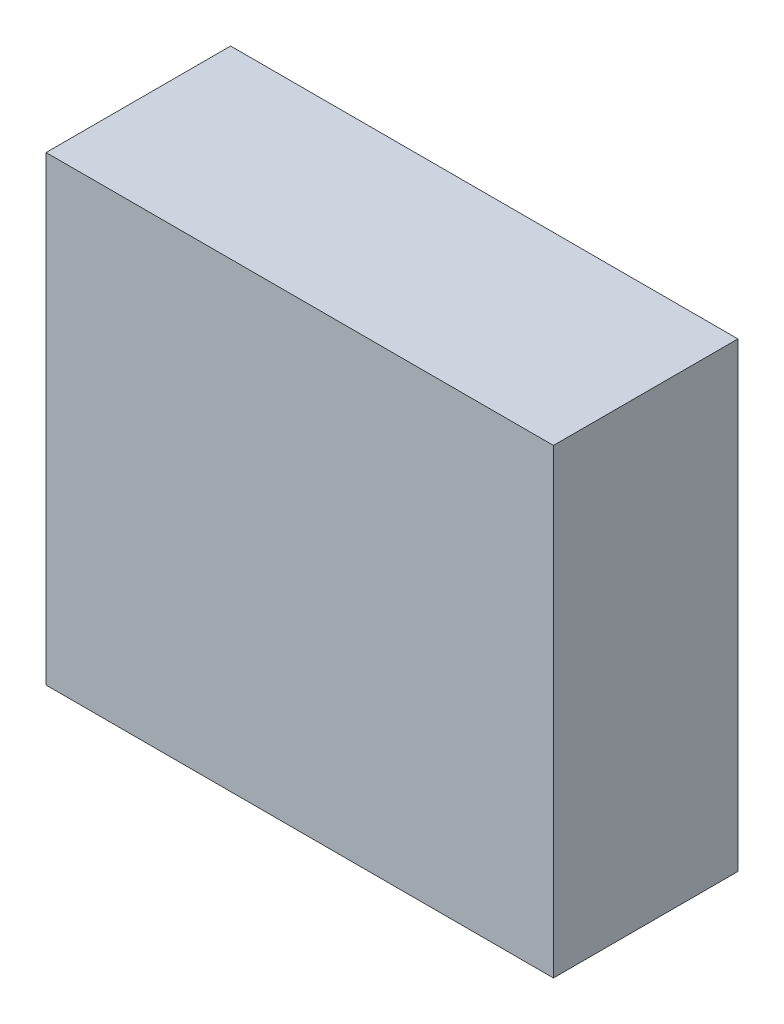
ISO-10303-21;
HEADER;
FILE_DESCRIPTION(('STEP AP214'),'2;1');
FILE_NAME('part.step','',(''),(''),'','','');
FILE_SCHEMA(('AUTOMOTIVE_DESIGN { 1 0 10303 214 1 1 1 1 }'));
ENDSEC;
DATA;
#1=APPLICATION_CONTEXT('core data for automotive mechanical design processes');
#2=APPLICATION_PROTOCOL_DEFINITION('international standard','automotive_design',2000,#1);
#3=PRODUCT_CONTEXT('',#1,'mechanical');
#4=PRODUCT('Part','Part','',(#3));
#5=PRODUCT_RELATED_PRODUCT_CATEGORY('part','',(#4));
#6=PRODUCT_DEFINITION_FORMATION('','',#4);
#7=PRODUCT_DEFINITION_CONTEXT('part definition',#1,'design');
#8=PRODUCT_DEFINITION('design','',#6,#7);
#9=PRODUCT_DEFINITION_SHAPE('','',#8);
#10=(LENGTH_UNIT() NAMED_UNIT(*) SI_UNIT(.MILLI.,.METRE.));
#11=(NAMED_UNIT(*) PLANE_ANGLE_UNIT() SI_UNIT($,.RADIAN.));
#12=(NAMED_UNIT(*) SI_UNIT($,.STERADIAN.) SOLID_ANGLE_UNIT());
#13=UNCERTAINTY_MEASURE_WITH_UNIT(LENGTH_MEASURE(1.E-05),#10,'distance_accuracy_value','');
#14=(GEOMETRIC_REPRESENTATION_CONTEXT(3) GLOBAL_UNCERTAINTY_ASSIGNED_CONTEXT((#13)) GLOBAL_UNIT_ASSIGNED_CONTEXT((#10,
#11,#12)) REPRESENTATION_CONTEXT('',''));
#15=CARTESIAN_POINT('',(0.,0.,0.));
#16=DIRECTION('',(0.,0.,1.));
#17=DIRECTION('',(1.,0.,0.));
#18=AXIS2_PLACEMENT_3D('',#15,#16,#17);
#19=CARTESIAN_POINT('',(44.015152,39.47668,1.13792));
#20=DIRECTION('',(0.,0.,1.));
#21=DIRECTION('',(0.,1.,0.));
#22=AXIS2_PLACEMENT_3D('',#19,#20,#21);
#23=PLANE('',#22);
#24=DIRECTION('',(0.,1.,0.));
#25=VECTOR('',#24,1.);
#26=CARTESIAN_POINT('',(42.8752,40.005,1.13792));
#27=LINE('',#26,#25);
#28=CARTESIAN_POINT('',(42.8752,40.513,1.13792));
#29=VERTEX_POINT('',#28);
#30=CARTESIAN_POINT('',(42.8752,39.497,1.13792));
#31=VERTEX_POINT('',#30);
#32=EDGE_CURVE('E76',#29,#31,#27,.F.);
#33=ORIENTED_EDGE('',*,*,#32,.T.);
#34=DIRECTION('',(-1.,0.,0.));
#35=VECTOR('',#34,1.);
#36=CARTESIAN_POINT('',(43.434,39.497,1.13792));
#37=LINE('',#36,#35);
#38=CARTESIAN_POINT('',(43.9928,39.497,1.13792));
#39=VERTEX_POINT('',#38);
#40=EDGE_CURVE('E58',#31,#39,#37,.F.);
#41=ORIENTED_EDGE('',*,*,#40,.T.);
#42=DIRECTION('',(0.,-1.,0.));
#43=VECTOR('',#42,1.);
#44=CARTESIAN_POINT('',(43.9928,40.005,1.13792));
#45=LINE('',#44,#43);
#46=CARTESIAN_POINT('',(43.9928,40.513,1.13792));
#47=VERTEX_POINT('',#46);
#48=EDGE_CURVE('E20',#39,#47,#45,.F.);
#49=ORIENTED_EDGE('',*,*,#48,.T.);
#50=DIRECTION('',(1.,0.,0.));
#51=VECTOR('',#50,1.);
#52=CARTESIAN_POINT('',(43.434,40.513,1.13792));
#53=LINE('',#52,#51);
#54=EDGE_CURVE('E55',#47,#29,#53,.F.);
#55=ORIENTED_EDGE('',*,*,#54,.T.);
#56=EDGE_LOOP('',(#33,#41,#49,#55));
#57=FACE_BOUND('',#56,.T.);
#58=ADVANCED_FACE('F16',(#57),#23,.T.);
#59=CARTESIAN_POINT('',(43.9928,39.47668,0.723392));
#60=DIRECTION('',(1.,0.,0.));
#61=DIRECTION('',(0.,1.,0.));
#62=AXIS2_PLACEMENT_3D('',#59,#60,#61);
#63=PLANE('',#62);
#64=ORIENTED_EDGE('',*,*,#48,.F.);
#65=DIRECTION('',(0.,0.,1.));
#66=VECTOR('',#65,1.);
#67=CARTESIAN_POINT('',(43.9928,39.497,0.93472));
#68=LINE('',#67,#66);
#69=CARTESIAN_POINT('',(43.9928,39.497,0.73152));
#70=VERTEX_POINT('',#69);
#71=EDGE_CURVE('E80',#39,#70,#68,.F.);
#72=ORIENTED_EDGE('',*,*,#71,.T.);
#73=DIRECTION('',(0.,1.,0.));
#74=VECTOR('',#73,1.);
#75=CARTESIAN_POINT('',(43.9928,40.005,0.73152));
#76=LINE('',#75,#74);
#77=CARTESIAN_POINT('',(43.9928,40.513,0.73152));
#78=VERTEX_POINT('',#77);
#79=EDGE_CURVE('E73',#70,#78,#76,.T.);
#80=ORIENTED_EDGE('',*,*,#79,.T.);
#81=DIRECTION('',(0.,0.,-1.));
#82=VECTOR('',#81,1.);
#83=CARTESIAN_POINT('',(43.9928,40.513,0.93472));
#84=LINE('',#83,#82);
#85=EDGE_CURVE('E63',#78,#47,#84,.F.);
#86=ORIENTED_EDGE('',*,*,#85,.T.);
#87=EDGE_LOOP('',(#64,#72,#80,#86));
#88=FACE_BOUND('',#87,.T.);
#89=ADVANCED_FACE('F72',(#88),#63,.T.);
#90=CARTESIAN_POINT('',(44.015152,40.513,0.723392));
#91=DIRECTION('',(0.,1.,0.));
#92=DIRECTION('',(-1.,0.,0.));
#93=AXIS2_PLACEMENT_3D('',#90,#91,#92);
#94=PLANE('',#93);
#95=ORIENTED_EDGE('',*,*,#54,.F.);
#96=ORIENTED_EDGE('',*,*,#85,.F.);
#97=DIRECTION('',(-1.,0.,0.));
#98=VECTOR('',#97,1.);
#99=CARTESIAN_POINT('',(43.434,40.513,0.73152));
#100=LINE('',#99,#98);
#101=CARTESIAN_POINT('',(42.8752,40.513,0.73152));
#102=VERTEX_POINT('',#101);
#103=EDGE_CURVE('E83',#78,#102,#100,.T.);
#104=ORIENTED_EDGE('',*,*,#103,.T.);
#105=DIRECTION('',(0.,0.,-1.));
#106=VECTOR('',#105,1.);
#107=CARTESIAN_POINT('',(42.8752,40.513,0.93472));
#108=LINE('',#107,#106);
#109=EDGE_CURVE('E69',#102,#29,#108,.F.);
#110=ORIENTED_EDGE('',*,*,#109,.T.);
#111=EDGE_LOOP('',(#95,#96,#104,#110));
#112=FACE_BOUND('',#111,.T.);
#113=ADVANCED_FACE('F66',(#112),#94,.T.);
#114=CARTESIAN_POINT('',(42.8752,40.53332,0.723392));
#115=DIRECTION('',(-1.,0.,0.));
#116=DIRECTION('',(0.,-1.,0.));
#117=AXIS2_PLACEMENT_3D('',#114,#115,#116);
#118=PLANE('',#117);
#119=ORIENTED_EDGE('',*,*,#32,.F.);
#120=ORIENTED_EDGE('',*,*,#109,.F.);
#121=DIRECTION('',(0.,-1.,0.));
#122=VECTOR('',#121,1.);
#123=CARTESIAN_POINT('',(42.8752,40.005,0.73152));
#124=LINE('',#123,#122);
#125=CARTESIAN_POINT('',(42.8752,39.497,0.73152));
#126=VERTEX_POINT('',#125);
#127=EDGE_CURVE('E26',#102,#126,#124,.T.);
#128=ORIENTED_EDGE('',*,*,#127,.T.);
#129=DIRECTION('',(0.,0.,-1.));
#130=VECTOR('',#129,1.);
#131=CARTESIAN_POINT('',(42.8752,39.497,0.93472));
#132=LINE('',#131,#130);
#133=EDGE_CURVE('E34',#126,#31,#132,.F.);
#134=ORIENTED_EDGE('',*,*,#133,.T.);
#135=EDGE_LOOP('',(#119,#120,#128,#134));
#136=FACE_BOUND('',#135,.T.);
#137=ADVANCED_FACE('F88',(#136),#118,.T.);
#138=CARTESIAN_POINT('',(42.852848,39.497,0.723392));
#139=DIRECTION('',(0.,-1.,0.));
#140=DIRECTION('',(1.,0.,0.));
#141=AXIS2_PLACEMENT_3D('',#138,#139,#140);
#142=PLANE('',#141);
#143=ORIENTED_EDGE('',*,*,#40,.F.);
#144=ORIENTED_EDGE('',*,*,#133,.F.);
#145=DIRECTION('',(1.,0.,0.));
#146=VECTOR('',#145,1.);
#147=CARTESIAN_POINT('',(43.434,39.497,0.73152));
#148=LINE('',#147,#146);
#149=EDGE_CURVE('E11',#126,#70,#148,.T.);
#150=ORIENTED_EDGE('',*,*,#149,.T.);
#151=ORIENTED_EDGE('',*,*,#71,.F.);
#152=EDGE_LOOP('',(#143,#144,#150,#151));
#153=FACE_BOUND('',#152,.T.);
#154=ADVANCED_FACE('F90',(#153),#142,.T.);
#155=CARTESIAN_POINT('',(44.015152,39.47668,0.73152));
#156=DIRECTION('',(0.,0.,1.));
#157=DIRECTION('',(0.,1.,0.));
#158=AXIS2_PLACEMENT_3D('',#155,#156,#157);
#159=PLANE('',#158);
#160=ORIENTED_EDGE('',*,*,#127,.F.);
#161=ORIENTED_EDGE('',*,*,#103,.F.);
#162=ORIENTED_EDGE('',*,*,#79,.F.);
#163=ORIENTED_EDGE('',*,*,#149,.F.);
#164=EDGE_LOOP('',(#160,#161,#162,#163));
#165=FACE_BOUND('',#164,.T.);
#166=ADVANCED_FACE('F18',(#165),#159,.F.);
#167=CLOSED_SHELL('',(#58,#89,#113,#137,#154,#166));
#168=MANIFOLD_SOLID_BREP('B1',#167);
#169=ADVANCED_BREP_SHAPE_REPRESENTATION('',(#18,#168),#14);
#170=SHAPE_DEFINITION_REPRESENTATION(#9,#169);
ENDSEC;
END-ISO-10303-21;
